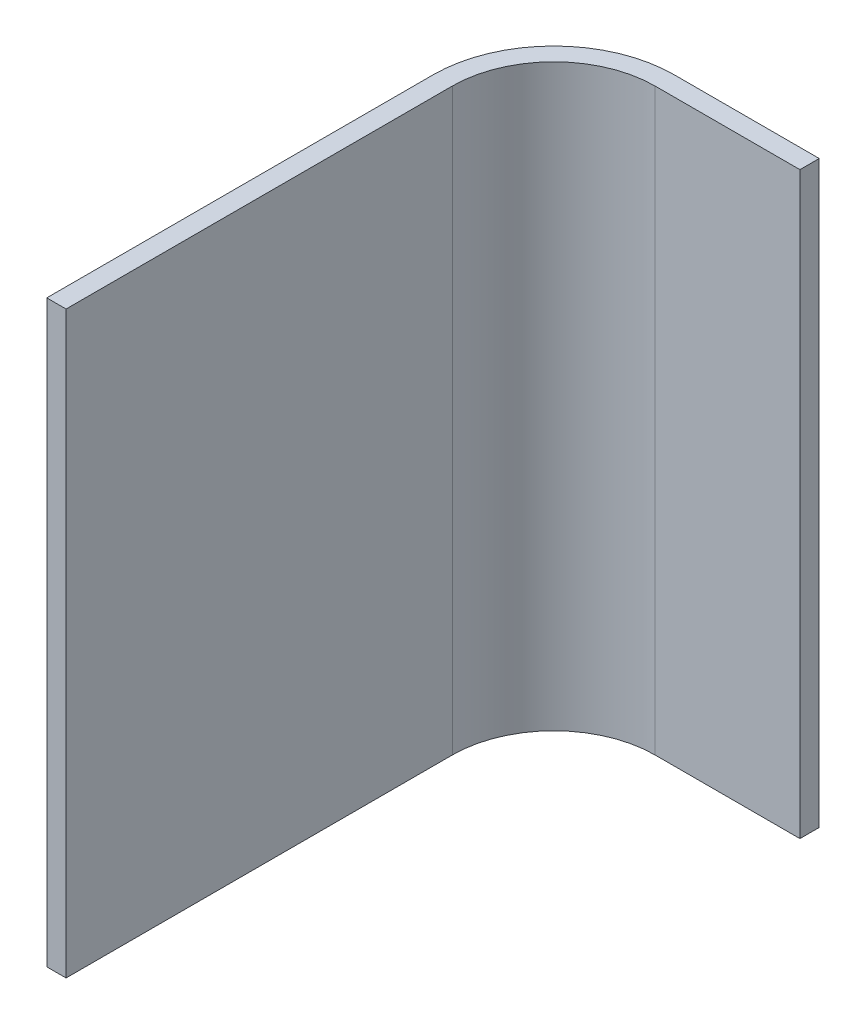
ISO-10303-21;
HEADER;
FILE_DESCRIPTION(('STEP AP214'),'2;1');
FILE_NAME('part.step','',(''),(''),'','','');
FILE_SCHEMA(('AUTOMOTIVE_DESIGN { 1 0 10303 214 1 1 1 1 }'));
ENDSEC;
DATA;
#1=APPLICATION_CONTEXT('core data for automotive mechanical design processes');
#2=APPLICATION_PROTOCOL_DEFINITION('international standard','automotive_design',2000,#1);
#3=PRODUCT_CONTEXT('',#1,'mechanical');
#4=PRODUCT('Part','Part','',(#3));
#5=PRODUCT_RELATED_PRODUCT_CATEGORY('part','',(#4));
#6=PRODUCT_DEFINITION_FORMATION('','',#4);
#7=PRODUCT_DEFINITION_CONTEXT('part definition',#1,'design');
#8=PRODUCT_DEFINITION('design','',#6,#7);
#9=PRODUCT_DEFINITION_SHAPE('','',#8);
#10=(LENGTH_UNIT() NAMED_UNIT(*) SI_UNIT(.MILLI.,.METRE.));
#11=(NAMED_UNIT(*) PLANE_ANGLE_UNIT() SI_UNIT($,.RADIAN.));
#12=(NAMED_UNIT(*) SI_UNIT($,.STERADIAN.) SOLID_ANGLE_UNIT());
#13=UNCERTAINTY_MEASURE_WITH_UNIT(LENGTH_MEASURE(1.E-05),#10,'distance_accuracy_value','');
#14=(GEOMETRIC_REPRESENTATION_CONTEXT(3) GLOBAL_UNCERTAINTY_ASSIGNED_CONTEXT((#13)) GLOBAL_UNIT_ASSIGNED_CONTEXT((#10,
#11,#12)) REPRESENTATION_CONTEXT('',''));
#15=CARTESIAN_POINT('',(0.,0.,0.));
#16=DIRECTION('',(0.,0.,1.));
#17=DIRECTION('',(1.,0.,0.));
#18=AXIS2_PLACEMENT_3D('',#15,#16,#17);
#19=CARTESIAN_POINT('',(25.,120.,-101.));
#20=DIRECTION('',(0.,0.,-1.));
#21=DIRECTION('',(-1.,0.,0.));
#22=AXIS2_PLACEMENT_3D('',#19,#20,#21);
#23=PLANE('',#22);
#24=DIRECTION('',(1.,0.,0.));
#25=VECTOR('',#24,1.);
#26=CARTESIAN_POINT('',(25.,0.,-101.));
#27=LINE('',#26,#25);
#28=CARTESIAN_POINT('',(25.,0.,-101.));
#29=VERTEX_POINT('',#28);
#30=CARTESIAN_POINT('',(55.,0.,-101.));
#31=VERTEX_POINT('',#30);
#32=EDGE_CURVE('E138',#29,#31,#27,.T.);
#33=ORIENTED_EDGE('',*,*,#32,.T.);
#34=DIRECTION('',(0.,-1.,0.));
#35=VECTOR('',#34,1.);
#36=CARTESIAN_POINT('',(55.,120.,-101.));
#37=LINE('',#36,#35);
#38=CARTESIAN_POINT('',(55.,120.,-101.));
#39=VERTEX_POINT('',#38);
#40=EDGE_CURVE('E11',#39,#31,#37,.T.);
#41=ORIENTED_EDGE('',*,*,#40,.F.);
#42=DIRECTION('',(1.,0.,0.));
#43=VECTOR('',#42,1.);
#44=CARTESIAN_POINT('',(25.,120.,-101.));
#45=LINE('',#44,#43);
#46=CARTESIAN_POINT('',(25.,120.,-101.));
#47=VERTEX_POINT('',#46);
#48=EDGE_CURVE('E96',#47,#39,#45,.T.);
#49=ORIENTED_EDGE('',*,*,#48,.F.);
#50=DIRECTION('',(0.,-1.,0.));
#51=VECTOR('',#50,1.);
#52=CARTESIAN_POINT('',(25.,120.,-101.));
#53=LINE('',#52,#51);
#54=EDGE_CURVE('E137',#47,#29,#53,.T.);
#55=ORIENTED_EDGE('',*,*,#54,.T.);
#56=EDGE_LOOP('',(#33,#41,#49,#55));
#57=FACE_BOUND('',#56,.T.);
#58=ADVANCED_FACE('F41',(#57),#23,.F.);
#59=CARTESIAN_POINT('',(55.,120.,-105.));
#60=DIRECTION('',(1.,0.,0.));
#61=DIRECTION('',(0.,0.,-1.));
#62=AXIS2_PLACEMENT_3D('',#59,#60,#61);
#63=PLANE('',#62);
#64=DIRECTION('',(0.,0.,1.));
#65=VECTOR('',#64,1.);
#66=CARTESIAN_POINT('',(55.,0.,-105.));
#67=LINE('',#66,#65);
#68=CARTESIAN_POINT('',(55.,0.,-105.));
#69=VERTEX_POINT('',#68);
#70=EDGE_CURVE('E141',#69,#31,#67,.T.);
#71=ORIENTED_EDGE('',*,*,#70,.F.);
#72=DIRECTION('',(0.,-1.,0.));
#73=VECTOR('',#72,1.);
#74=CARTESIAN_POINT('',(55.,120.,-105.));
#75=LINE('',#74,#73);
#76=CARTESIAN_POINT('',(55.,120.,-105.));
#77=VERTEX_POINT('',#76);
#78=EDGE_CURVE('E49',#77,#69,#75,.T.);
#79=ORIENTED_EDGE('',*,*,#78,.F.);
#80=DIRECTION('',(0.,0.,1.));
#81=VECTOR('',#80,1.);
#82=CARTESIAN_POINT('',(55.,120.,-105.));
#83=LINE('',#82,#81);
#84=EDGE_CURVE('E180',#77,#39,#83,.T.);
#85=ORIENTED_EDGE('',*,*,#84,.T.);
#86=ORIENTED_EDGE('',*,*,#40,.T.);
#87=EDGE_LOOP('',(#71,#79,#85,#86));
#88=FACE_BOUND('',#87,.T.);
#89=ADVANCED_FACE('F171',(#88),#63,.T.);
#90=CARTESIAN_POINT('',(25.,120.,-105.));
#91=DIRECTION('',(0.,0.,-1.));
#92=DIRECTION('',(-1.,0.,0.));
#93=AXIS2_PLACEMENT_3D('',#90,#91,#92);
#94=PLANE('',#93);
#95=DIRECTION('',(1.,0.,0.));
#96=VECTOR('',#95,1.);
#97=CARTESIAN_POINT('',(25.,0.,-105.));
#98=LINE('',#97,#96);
#99=CARTESIAN_POINT('',(25.,0.,-105.));
#100=VERTEX_POINT('',#99);
#101=EDGE_CURVE('E144',#100,#69,#98,.T.);
#102=ORIENTED_EDGE('',*,*,#101,.F.);
#103=DIRECTION('',(0.,-1.,0.));
#104=VECTOR('',#103,1.);
#105=CARTESIAN_POINT('',(25.,120.,-105.));
#106=LINE('',#105,#104);
#107=CARTESIAN_POINT('',(25.,120.,-105.));
#108=VERTEX_POINT('',#107);
#109=EDGE_CURVE('E161',#108,#100,#106,.T.);
#110=ORIENTED_EDGE('',*,*,#109,.F.);
#111=DIRECTION('',(1.,0.,0.));
#112=VECTOR('',#111,1.);
#113=CARTESIAN_POINT('',(25.,120.,-105.));
#114=LINE('',#113,#112);
#115=EDGE_CURVE('E168',#108,#77,#114,.T.);
#116=ORIENTED_EDGE('',*,*,#115,.T.);
#117=ORIENTED_EDGE('',*,*,#78,.T.);
#118=EDGE_LOOP('',(#102,#110,#116,#117));
#119=FACE_BOUND('',#118,.T.);
#120=ADVANCED_FACE('F166',(#119),#94,.T.);
#121=CARTESIAN_POINT('',(25.,120.,-80.));
#122=DIRECTION('',(0.,-1.,0.));
#123=DIRECTION('',(0.,0.,-1.));
#124=AXIS2_PLACEMENT_3D('',#121,#122,#123);
#125=CYLINDRICAL_SURFACE('',#124,25.);
#126=CARTESIAN_POINT('',(25.,0.,-80.));
#127=DIRECTION('',(0.,-1.,0.));
#128=DIRECTION('',(0.,0.,-1.));
#129=AXIS2_PLACEMENT_3D('',#126,#127,#128);
#130=CIRCLE('',#129,25.);
#131=CARTESIAN_POINT('',(0.,0.,-80.));
#132=VERTEX_POINT('',#131);
#133=EDGE_CURVE('E147',#132,#100,#130,.T.);
#134=ORIENTED_EDGE('',*,*,#133,.F.);
#135=DIRECTION('',(0.,-1.,0.));
#136=VECTOR('',#135,1.);
#137=CARTESIAN_POINT('',(0.,120.,-80.));
#138=LINE('',#137,#136);
#139=CARTESIAN_POINT('',(0.,120.,-80.));
#140=VERTEX_POINT('',#139);
#141=EDGE_CURVE('E159',#140,#132,#138,.T.);
#142=ORIENTED_EDGE('',*,*,#141,.F.);
#143=CARTESIAN_POINT('',(25.,120.,-80.));
#144=DIRECTION('',(0.,-1.,0.));
#145=DIRECTION('',(0.,0.,-1.));
#146=AXIS2_PLACEMENT_3D('',#143,#144,#145);
#147=CIRCLE('',#146,25.);
#148=EDGE_CURVE('E132',#140,#108,#147,.T.);
#149=ORIENTED_EDGE('',*,*,#148,.T.);
#150=ORIENTED_EDGE('',*,*,#109,.T.);
#151=EDGE_LOOP('',(#134,#142,#149,#150));
#152=FACE_BOUND('',#151,.T.);
#153=ADVANCED_FACE('F178',(#152),#125,.T.);
#154=CARTESIAN_POINT('',(0.,120.,0.));
#155=DIRECTION('',(-1.,0.,0.));
#156=DIRECTION('',(0.,0.,1.));
#157=AXIS2_PLACEMENT_3D('',#154,#155,#156);
#158=PLANE('',#157);
#159=DIRECTION('',(0.,0.,-1.));
#160=VECTOR('',#159,1.);
#161=CARTESIAN_POINT('',(0.,0.,0.));
#162=LINE('',#161,#160);
#163=CARTESIAN_POINT('',(0.,0.,0.));
#164=VERTEX_POINT('',#163);
#165=EDGE_CURVE('E150',#164,#132,#162,.T.);
#166=ORIENTED_EDGE('',*,*,#165,.F.);
#167=DIRECTION('',(0.,-1.,0.));
#168=VECTOR('',#167,1.);
#169=CARTESIAN_POINT('',(0.,120.,0.));
#170=LINE('',#169,#168);
#171=CARTESIAN_POINT('',(0.,120.,0.));
#172=VERTEX_POINT('',#171);
#173=EDGE_CURVE('E120',#172,#164,#170,.T.);
#174=ORIENTED_EDGE('',*,*,#173,.F.);
#175=DIRECTION('',(0.,0.,-1.));
#176=VECTOR('',#175,1.);
#177=CARTESIAN_POINT('',(0.,120.,0.));
#178=LINE('',#177,#176);
#179=EDGE_CURVE('E130',#172,#140,#178,.T.);
#180=ORIENTED_EDGE('',*,*,#179,.T.);
#181=ORIENTED_EDGE('',*,*,#141,.T.);
#182=EDGE_LOOP('',(#166,#174,#180,#181));
#183=FACE_BOUND('',#182,.T.);
#184=ADVANCED_FACE('F185',(#183),#158,.T.);
#185=CARTESIAN_POINT('',(4.,120.,0.));
#186=DIRECTION('',(0.,0.,1.));
#187=DIRECTION('',(1.,0.,0.));
#188=AXIS2_PLACEMENT_3D('',#185,#186,#187);
#189=PLANE('',#188);
#190=DIRECTION('',(-1.,0.,0.));
#191=VECTOR('',#190,1.);
#192=CARTESIAN_POINT('',(4.,0.,0.));
#193=LINE('',#192,#191);
#194=CARTESIAN_POINT('',(4.,0.,0.));
#195=VERTEX_POINT('',#194);
#196=EDGE_CURVE('E119',#195,#164,#193,.T.);
#197=ORIENTED_EDGE('',*,*,#196,.F.);
#198=DIRECTION('',(0.,-1.,0.));
#199=VECTOR('',#198,1.);
#200=CARTESIAN_POINT('',(4.,120.,0.));
#201=LINE('',#200,#199);
#202=CARTESIAN_POINT('',(4.,120.,0.));
#203=VERTEX_POINT('',#202);
#204=EDGE_CURVE('E113',#203,#195,#201,.T.);
#205=ORIENTED_EDGE('',*,*,#204,.F.);
#206=DIRECTION('',(-1.,0.,0.));
#207=VECTOR('',#206,1.);
#208=CARTESIAN_POINT('',(4.,120.,0.));
#209=LINE('',#208,#207);
#210=EDGE_CURVE('E117',#203,#172,#209,.T.);
#211=ORIENTED_EDGE('',*,*,#210,.T.);
#212=ORIENTED_EDGE('',*,*,#173,.T.);
#213=EDGE_LOOP('',(#197,#205,#211,#212));
#214=FACE_BOUND('',#213,.T.);
#215=ADVANCED_FACE('F115',(#214),#189,.T.);
#216=CARTESIAN_POINT('',(4.,120.,0.));
#217=DIRECTION('',(-1.,0.,0.));
#218=DIRECTION('',(0.,0.,1.));
#219=AXIS2_PLACEMENT_3D('',#216,#217,#218);
#220=PLANE('',#219);
#221=DIRECTION('',(0.,0.,-1.));
#222=VECTOR('',#221,1.);
#223=CARTESIAN_POINT('',(4.,0.,0.));
#224=LINE('',#223,#222);
#225=CARTESIAN_POINT('',(3.99999999999999,0.,-80.));
#226=VERTEX_POINT('',#225);
#227=EDGE_CURVE('E84',#195,#226,#224,.T.);
#228=ORIENTED_EDGE('',*,*,#227,.T.);
#229=DIRECTION('',(0.,-1.,0.));
#230=VECTOR('',#229,1.);
#231=CARTESIAN_POINT('',(3.99999999999999,120.,-80.));
#232=LINE('',#231,#230);
#233=CARTESIAN_POINT('',(3.99999999999999,120.,-80.));
#234=VERTEX_POINT('',#233);
#235=EDGE_CURVE('E121',#234,#226,#232,.T.);
#236=ORIENTED_EDGE('',*,*,#235,.F.);
#237=DIRECTION('',(0.,0.,-1.));
#238=VECTOR('',#237,1.);
#239=CARTESIAN_POINT('',(4.,120.,0.));
#240=LINE('',#239,#238);
#241=EDGE_CURVE('E123',#203,#234,#240,.T.);
#242=ORIENTED_EDGE('',*,*,#241,.F.);
#243=ORIENTED_EDGE('',*,*,#204,.T.);
#244=EDGE_LOOP('',(#228,#236,#242,#243));
#245=FACE_BOUND('',#244,.T.);
#246=ADVANCED_FACE('F124',(#245),#220,.F.);
#247=CARTESIAN_POINT('',(25.,120.,-80.));
#248=DIRECTION('',(0.,-1.,0.));
#249=DIRECTION('',(0.,0.,-1.));
#250=AXIS2_PLACEMENT_3D('',#247,#248,#249);
#251=CYLINDRICAL_SURFACE('',#250,21.);
#252=CARTESIAN_POINT('',(25.,0.,-80.));
#253=DIRECTION('',(0.,1.,0.));
#254=DIRECTION('',(1.,0.,0.));
#255=AXIS2_PLACEMENT_3D('',#252,#253,#254);
#256=CIRCLE('',#255,21.);
#257=EDGE_CURVE('E90',#226,#29,#256,.F.);
#258=ORIENTED_EDGE('',*,*,#257,.T.);
#259=ORIENTED_EDGE('',*,*,#54,.F.);
#260=CARTESIAN_POINT('',(25.,120.,-80.));
#261=DIRECTION('',(0.,1.,0.));
#262=DIRECTION('',(1.,0.,0.));
#263=AXIS2_PLACEMENT_3D('',#260,#261,#262);
#264=CIRCLE('',#263,21.);
#265=EDGE_CURVE('E57',#234,#47,#264,.F.);
#266=ORIENTED_EDGE('',*,*,#265,.F.);
#267=ORIENTED_EDGE('',*,*,#235,.T.);
#268=EDGE_LOOP('',(#258,#259,#266,#267));
#269=FACE_BOUND('',#268,.T.);
#270=ADVANCED_FACE('F187',(#269),#251,.F.);
#271=CARTESIAN_POINT('',(25.,120.,-80.));
#272=DIRECTION('',(0.,-1.,0.));
#273=DIRECTION('',(-1.,0.,0.));
#274=AXIS2_PLACEMENT_3D('',#271,#272,#273);
#275=PLANE('',#274);
#276=ORIENTED_EDGE('',*,*,#48,.T.);
#277=ORIENTED_EDGE('',*,*,#84,.F.);
#278=ORIENTED_EDGE('',*,*,#115,.F.);
#279=ORIENTED_EDGE('',*,*,#148,.F.);
#280=ORIENTED_EDGE('',*,*,#179,.F.);
#281=ORIENTED_EDGE('',*,*,#210,.F.);
#282=ORIENTED_EDGE('',*,*,#241,.T.);
#283=ORIENTED_EDGE('',*,*,#265,.T.);
#284=EDGE_LOOP('',(#276,#277,#278,#279,#280,#281,#282,#283));
#285=FACE_BOUND('',#284,.T.);
#286=ADVANCED_FACE('F127',(#285),#275,.F.);
#287=CARTESIAN_POINT('',(25.,0.,-80.));
#288=DIRECTION('',(0.,-1.,0.));
#289=DIRECTION('',(-1.,0.,0.));
#290=AXIS2_PLACEMENT_3D('',#287,#288,#289);
#291=PLANE('',#290);
#292=ORIENTED_EDGE('',*,*,#32,.F.);
#293=ORIENTED_EDGE('',*,*,#257,.F.);
#294=ORIENTED_EDGE('',*,*,#227,.F.);
#295=ORIENTED_EDGE('',*,*,#196,.T.);
#296=ORIENTED_EDGE('',*,*,#165,.T.);
#297=ORIENTED_EDGE('',*,*,#133,.T.);
#298=ORIENTED_EDGE('',*,*,#101,.T.);
#299=ORIENTED_EDGE('',*,*,#70,.T.);
#300=EDGE_LOOP('',(#292,#293,#294,#295,#296,#297,#298,#299));
#301=FACE_BOUND('',#300,.T.);
#302=ADVANCED_FACE('F174',(#301),#291,.T.);
#303=CLOSED_SHELL('',(#58,#89,#120,#153,#184,#215,#246,#270,#286,#302));
#304=MANIFOLD_SOLID_BREP('B2',#303);
#305=ADVANCED_BREP_SHAPE_REPRESENTATION('',(#18,#304),#14);
#306=SHAPE_DEFINITION_REPRESENTATION(#9,#305);
ENDSEC;
END-ISO-10303-21;
